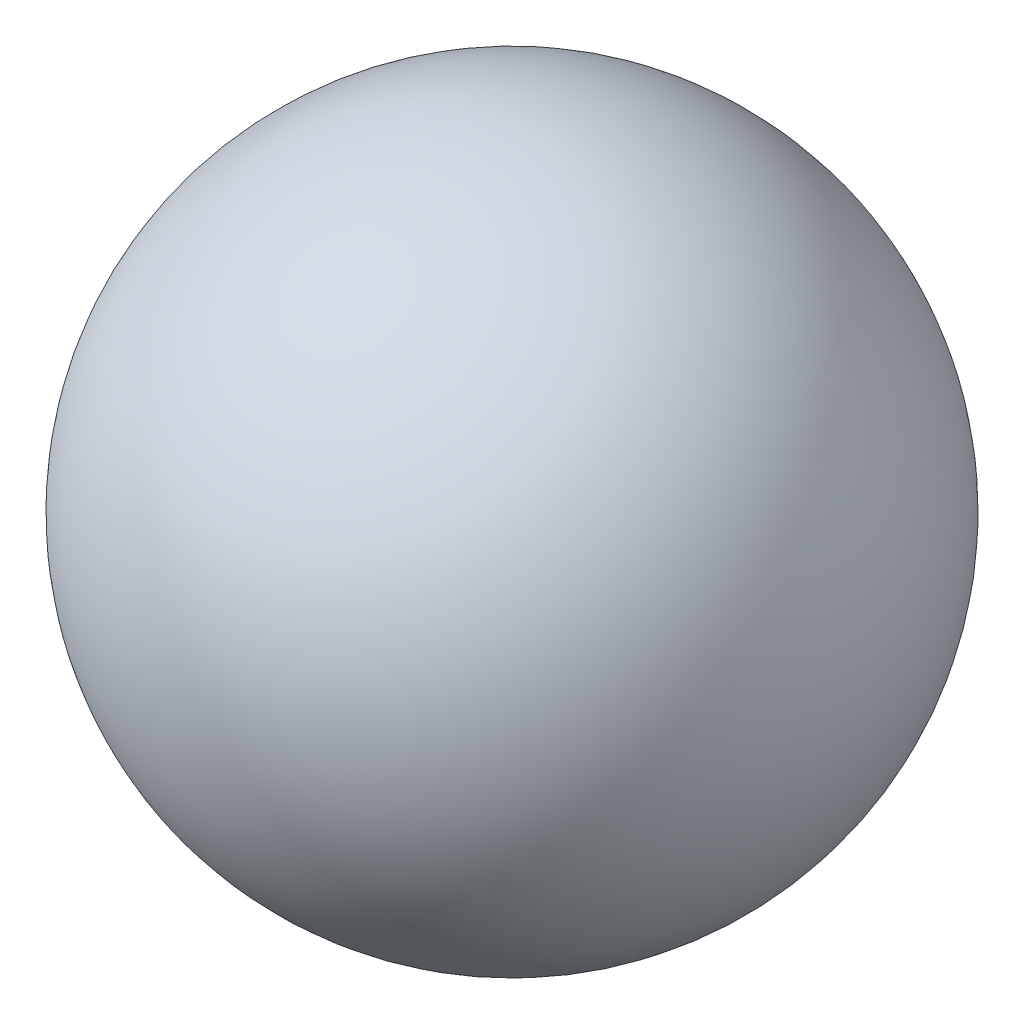
ISO-10303-21;
HEADER;
FILE_DESCRIPTION(('STEP AP214'),'2;1');
FILE_NAME('part.step','',(''),(''),'','','');
FILE_SCHEMA(('AUTOMOTIVE_DESIGN { 1 0 10303 214 1 1 1 1 }'));
ENDSEC;
DATA;
#1=APPLICATION_CONTEXT('core data for automotive mechanical design processes');
#2=APPLICATION_PROTOCOL_DEFINITION('international standard','automotive_design',2000,#1);
#3=PRODUCT_CONTEXT('',#1,'mechanical');
#4=PRODUCT('Part','Part','',(#3));
#5=PRODUCT_RELATED_PRODUCT_CATEGORY('part','',(#4));
#6=PRODUCT_DEFINITION_FORMATION('','',#4);
#7=PRODUCT_DEFINITION_CONTEXT('part definition',#1,'design');
#8=PRODUCT_DEFINITION('design','',#6,#7);
#9=PRODUCT_DEFINITION_SHAPE('','',#8);
#10=(LENGTH_UNIT() NAMED_UNIT(*) SI_UNIT(.MILLI.,.METRE.));
#11=(NAMED_UNIT(*) PLANE_ANGLE_UNIT() SI_UNIT($,.RADIAN.));
#12=(NAMED_UNIT(*) SI_UNIT($,.STERADIAN.) SOLID_ANGLE_UNIT());
#13=UNCERTAINTY_MEASURE_WITH_UNIT(LENGTH_MEASURE(1.E-05),#10,'distance_accuracy_value','');
#14=(GEOMETRIC_REPRESENTATION_CONTEXT(3) GLOBAL_UNCERTAINTY_ASSIGNED_CONTEXT((#13)) GLOBAL_UNIT_ASSIGNED_CONTEXT((#10,
#11,#12)) REPRESENTATION_CONTEXT('',''));
#15=CARTESIAN_POINT('',(0.,0.,0.));
#16=DIRECTION('',(0.,0.,1.));
#17=DIRECTION('',(1.,0.,0.));
#18=AXIS2_PLACEMENT_3D('',#15,#16,#17);
#19=CARTESIAN_POINT('',(8.88005749866254,-2.,-7.69461362385709));
#20=DIRECTION('',(0.,0.,1.));
#21=DIRECTION('',(1.,0.,0.));
#22=AXIS2_PLACEMENT_3D('',#19,#20,#21);
#23=SPHERICAL_SURFACE('',#22,1.05);
#24=CARTESIAN_POINT('',(8.88005749866254,-2.,-6.64461362385709));
#25=VERTEX_POINT('',#24);
#26=VERTEX_LOOP('',#25);
#27=FACE_BOUND('',#26,.T.);
#28=ADVANCED_FACE('F13',(#27),#23,.T.);
#29=CLOSED_SHELL('',(#28));
#30=MANIFOLD_SOLID_BREP('B1',#29);
#31=ADVANCED_BREP_SHAPE_REPRESENTATION('',(#18,#30),#14);
#32=SHAPE_DEFINITION_REPRESENTATION(#9,#31);
ENDSEC;
END-ISO-10303-21;
